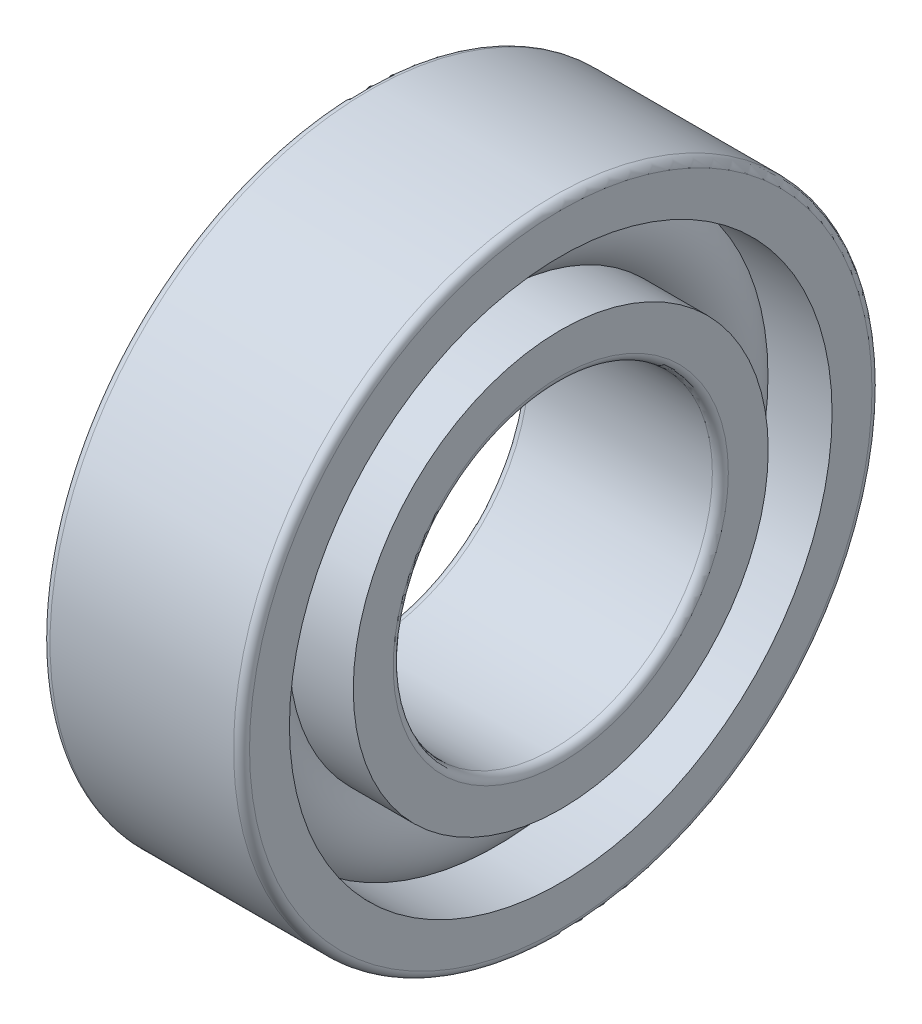
ISO-10303-21;
HEADER;
FILE_DESCRIPTION(('STEP AP214'),'2;1');
FILE_NAME('part.step','',(''),(''),'','','');
FILE_SCHEMA(('AUTOMOTIVE_DESIGN { 1 0 10303 214 1 1 1 1 }'));
ENDSEC;
DATA;
#1=APPLICATION_CONTEXT('core data for automotive mechanical design processes');
#2=APPLICATION_PROTOCOL_DEFINITION('international standard','automotive_design',2000,#1);
#3=PRODUCT_CONTEXT('',#1,'mechanical');
#4=PRODUCT('Part','Part','',(#3));
#5=PRODUCT_RELATED_PRODUCT_CATEGORY('part','',(#4));
#6=PRODUCT_DEFINITION_FORMATION('','',#4);
#7=PRODUCT_DEFINITION_CONTEXT('part definition',#1,'design');
#8=PRODUCT_DEFINITION('design','',#6,#7);
#9=PRODUCT_DEFINITION_SHAPE('','',#8);
#10=(LENGTH_UNIT() NAMED_UNIT(*) SI_UNIT(.MILLI.,.METRE.));
#11=(NAMED_UNIT(*) PLANE_ANGLE_UNIT() SI_UNIT($,.RADIAN.));
#12=(NAMED_UNIT(*) SI_UNIT($,.STERADIAN.) SOLID_ANGLE_UNIT());
#13=UNCERTAINTY_MEASURE_WITH_UNIT(LENGTH_MEASURE(1.E-05),#10,'distance_accuracy_value','');
#14=(GEOMETRIC_REPRESENTATION_CONTEXT(3) GLOBAL_UNCERTAINTY_ASSIGNED_CONTEXT((#13)) GLOBAL_UNIT_ASSIGNED_CONTEXT((#10,
#11,#12)) REPRESENTATION_CONTEXT('',''));
#15=CARTESIAN_POINT('',(0.,0.,0.));
#16=DIRECTION('',(0.,0.,1.));
#17=DIRECTION('',(1.,0.,0.));
#18=AXIS2_PLACEMENT_3D('',#15,#16,#17);
#19=CARTESIAN_POINT('',(0.,0.,0.));
#20=DIRECTION('',(-1.,0.,0.));
#21=DIRECTION('',(0.,0.,1.));
#22=AXIS2_PLACEMENT_3D('',#19,#20,#21);
#23=TOROIDAL_SURFACE('',#22,6.,1.2);
#24=CARTESIAN_POINT('',(0.894427190999912,0.,0.));
#25=DIRECTION('',(-1.,0.,0.));
#26=DIRECTION('',(0.,0.,1.));
#27=AXIS2_PLACEMENT_3D('',#24,#25,#26);
#28=CIRCLE('',#27,6.8);
#29=CARTESIAN_POINT('',(0.894427190999912,0.,6.8));
#30=VERTEX_POINT('',#29);
#31=EDGE_CURVE('E39',#30,#30,#28,.F.);
#32=ORIENTED_EDGE('',*,*,#31,.T.);
#33=EDGE_LOOP('',(#32));
#34=FACE_BOUND('',#33,.T.);
#35=CARTESIAN_POINT('',(0.894427190999914,0.,0.));
#36=DIRECTION('',(-1.,0.,0.));
#37=DIRECTION('',(0.,0.,1.));
#38=AXIS2_PLACEMENT_3D('',#35,#36,#37);
#39=CIRCLE('',#38,5.2);
#40=CARTESIAN_POINT('',(0.894427190999914,0.,5.2));
#41=VERTEX_POINT('',#40);
#42=EDGE_CURVE('E10',#41,#41,#39,.T.);
#43=ORIENTED_EDGE('',*,*,#42,.T.);
#44=EDGE_LOOP('',(#43));
#45=FACE_BOUND('',#44,.T.);
#46=ADVANCED_FACE('F35',(#34,#45),#23,.T.);
#47=CARTESIAN_POINT('',(-20.6375,0.,0.));
#48=DIRECTION('',(1.,0.,0.));
#49=DIRECTION('',(0.,0.,-1.));
#50=AXIS2_PLACEMENT_3D('',#47,#48,#49);
#51=CYLINDRICAL_SURFACE('',#50,5.2);
#52=CARTESIAN_POINT('',(2.5,0.,0.));
#53=DIRECTION('',(1.,0.,0.));
#54=DIRECTION('',(0.,0.,-1.));
#55=AXIS2_PLACEMENT_3D('',#52,#53,#54);
#56=CIRCLE('',#55,5.2);
#57=CARTESIAN_POINT('',(2.5,0.,-5.2));
#58=VERTEX_POINT('',#57);
#59=EDGE_CURVE('E48',#58,#58,#56,.T.);
#60=ORIENTED_EDGE('',*,*,#59,.F.);
#61=EDGE_LOOP('',(#60));
#62=FACE_BOUND('',#61,.T.);
#63=ORIENTED_EDGE('',*,*,#42,.F.);
#64=EDGE_LOOP('',(#63));
#65=FACE_BOUND('',#64,.T.);
#66=ADVANCED_FACE('F87',(#62,#65),#51,.T.);
#67=CARTESIAN_POINT('',(-20.6375,0.,0.));
#68=DIRECTION('',(1.,0.,0.));
#69=DIRECTION('',(0.,0.,-1.));
#70=AXIS2_PLACEMENT_3D('',#67,#68,#69);
#71=CYLINDRICAL_SURFACE('',#70,5.2);
#72=CARTESIAN_POINT('',(-2.5,0.,0.));
#73=DIRECTION('',(1.,0.,0.));
#74=DIRECTION('',(0.,0.,-1.));
#75=AXIS2_PLACEMENT_3D('',#72,#73,#74);
#76=CIRCLE('',#75,5.2);
#77=CARTESIAN_POINT('',(-2.5,0.,-5.2));
#78=VERTEX_POINT('',#77);
#79=EDGE_CURVE('E57',#78,#78,#76,.T.);
#80=ORIENTED_EDGE('',*,*,#79,.T.);
#81=EDGE_LOOP('',(#80));
#82=FACE_BOUND('',#81,.T.);
#83=CARTESIAN_POINT('',(-0.894427190999914,0.,0.));
#84=DIRECTION('',(1.,0.,0.));
#85=DIRECTION('',(0.,0.,-1.));
#86=AXIS2_PLACEMENT_3D('',#83,#84,#85);
#87=CIRCLE('',#86,5.2);
#88=CARTESIAN_POINT('',(-0.894427190999914,0.,-5.2));
#89=VERTEX_POINT('',#88);
#90=EDGE_CURVE('E43',#89,#89,#87,.T.);
#91=ORIENTED_EDGE('',*,*,#90,.F.);
#92=EDGE_LOOP('',(#91));
#93=FACE_BOUND('',#92,.T.);
#94=ADVANCED_FACE('F90',(#82,#93),#71,.T.);
#95=CARTESIAN_POINT('',(2.5,4.2,0.));
#96=DIRECTION('',(1.,0.,0.));
#97=DIRECTION('',(0.,0.,-1.));
#98=AXIS2_PLACEMENT_3D('',#95,#96,#97);
#99=PLANE('',#98);
#100=ORIENTED_EDGE('',*,*,#59,.T.);
#101=EDGE_LOOP('',(#100));
#102=FACE_BOUND('',#101,.T.);
#103=CARTESIAN_POINT('',(2.5,0.,0.));
#104=DIRECTION('',(1.,0.,0.));
#105=DIRECTION('',(0.,0.,-1.));
#106=AXIS2_PLACEMENT_3D('',#103,#104,#105);
#107=CIRCLE('',#106,4.2);
#108=CARTESIAN_POINT('',(2.5,0.,-4.2));
#109=VERTEX_POINT('',#108);
#110=EDGE_CURVE('E79',#109,#109,#107,.T.);
#111=ORIENTED_EDGE('',*,*,#110,.F.);
#112=EDGE_LOOP('',(#111));
#113=FACE_BOUND('',#112,.T.);
#114=ADVANCED_FACE('F84',(#102,#113),#99,.T.);
#115=CARTESIAN_POINT('',(2.3,0.,0.));
#116=DIRECTION('',(1.,0.,0.));
#117=DIRECTION('',(0.,0.,-1.));
#118=AXIS2_PLACEMENT_3D('',#115,#116,#117);
#119=TOROIDAL_SURFACE('',#118,4.2,0.2);
#120=ORIENTED_EDGE('',*,*,#110,.T.);
#121=EDGE_LOOP('',(#120));
#122=FACE_BOUND('',#121,.T.);
#123=CARTESIAN_POINT('',(2.3,0.,0.));
#124=DIRECTION('',(1.,0.,0.));
#125=DIRECTION('',(0.,0.,-1.));
#126=AXIS2_PLACEMENT_3D('',#123,#124,#125);
#127=CIRCLE('',#126,4.);
#128=CARTESIAN_POINT('',(2.3,0.,-4.));
#129=VERTEX_POINT('',#128);
#130=EDGE_CURVE('E76',#129,#129,#127,.T.);
#131=ORIENTED_EDGE('',*,*,#130,.F.);
#132=EDGE_LOOP('',(#131));
#133=FACE_BOUND('',#132,.T.);
#134=ADVANCED_FACE('F101',(#122,#133),#119,.T.);
#135=CARTESIAN_POINT('',(-20.6375,0.,0.));
#136=DIRECTION('',(1.,0.,0.));
#137=DIRECTION('',(0.,0.,-1.));
#138=AXIS2_PLACEMENT_3D('',#135,#136,#137);
#139=CYLINDRICAL_SURFACE('',#138,4.);
#140=ORIENTED_EDGE('',*,*,#130,.T.);
#141=EDGE_LOOP('',(#140));
#142=FACE_BOUND('',#141,.T.);
#143=CARTESIAN_POINT('',(-2.3,0.,0.));
#144=DIRECTION('',(1.,0.,0.));
#145=DIRECTION('',(0.,0.,-1.));
#146=AXIS2_PLACEMENT_3D('',#143,#144,#145);
#147=CIRCLE('',#146,4.);
#148=CARTESIAN_POINT('',(-2.3,0.,-4.));
#149=VERTEX_POINT('',#148);
#150=EDGE_CURVE('E73',#149,#149,#147,.T.);
#151=ORIENTED_EDGE('',*,*,#150,.F.);
#152=EDGE_LOOP('',(#151));
#153=FACE_BOUND('',#152,.T.);
#154=ADVANCED_FACE('F104',(#142,#153),#139,.F.);
#155=CARTESIAN_POINT('',(-2.3,0.,0.));
#156=DIRECTION('',(1.,0.,0.));
#157=DIRECTION('',(0.,0.,-1.));
#158=AXIS2_PLACEMENT_3D('',#155,#156,#157);
#159=TOROIDAL_SURFACE('',#158,4.2,0.2);
#160=ORIENTED_EDGE('',*,*,#150,.T.);
#161=EDGE_LOOP('',(#160));
#162=FACE_BOUND('',#161,.T.);
#163=CARTESIAN_POINT('',(-2.5,0.,0.));
#164=DIRECTION('',(1.,0.,0.));
#165=DIRECTION('',(0.,0.,-1.));
#166=AXIS2_PLACEMENT_3D('',#163,#164,#165);
#167=CIRCLE('',#166,4.2);
#168=CARTESIAN_POINT('',(-2.5,0.,-4.2));
#169=VERTEX_POINT('',#168);
#170=EDGE_CURVE('E70',#169,#169,#167,.T.);
#171=ORIENTED_EDGE('',*,*,#170,.F.);
#172=EDGE_LOOP('',(#171));
#173=FACE_BOUND('',#172,.T.);
#174=ADVANCED_FACE('F108',(#162,#173),#159,.T.);
#175=CARTESIAN_POINT('',(-2.5,5.2,0.));
#176=DIRECTION('',(-1.,0.,0.));
#177=DIRECTION('',(0.,0.,1.));
#178=AXIS2_PLACEMENT_3D('',#175,#176,#177);
#179=PLANE('',#178);
#180=ORIENTED_EDGE('',*,*,#170,.T.);
#181=EDGE_LOOP('',(#180));
#182=FACE_BOUND('',#181,.T.);
#183=ORIENTED_EDGE('',*,*,#79,.F.);
#184=EDGE_LOOP('',(#183));
#185=FACE_BOUND('',#184,.T.);
#186=ADVANCED_FACE('F112',(#182,#185),#179,.T.);
#187=CARTESIAN_POINT('',(-0.894427190999912,0.,0.));
#188=DIRECTION('',(1.,0.,0.));
#189=DIRECTION('',(0.,0.,-1.));
#190=AXIS2_PLACEMENT_3D('',#187,#188,#189);
#191=CIRCLE('',#190,6.8);
#192=CARTESIAN_POINT('',(-0.894427190999912,0.,-6.8));
#193=VERTEX_POINT('',#192);
#194=EDGE_CURVE('E51',#193,#193,#191,.F.);
#195=ORIENTED_EDGE('',*,*,#194,.T.);
#196=EDGE_LOOP('',(#195));
#197=FACE_BOUND('',#196,.T.);
#198=ORIENTED_EDGE('',*,*,#90,.T.);
#199=EDGE_LOOP('',(#198));
#200=FACE_BOUND('',#199,.T.);
#201=ADVANCED_FACE('F37',(#197,#200),#23,.T.);
#202=CARTESIAN_POINT('',(-20.6375,0.,0.));
#203=DIRECTION('',(1.,0.,0.));
#204=DIRECTION('',(0.,0.,-1.));
#205=AXIS2_PLACEMENT_3D('',#202,#203,#204);
#206=CYLINDRICAL_SURFACE('',#205,6.8);
#207=CARTESIAN_POINT('',(2.5,0.,0.));
#208=DIRECTION('',(1.,0.,0.));
#209=DIRECTION('',(0.,0.,-1.));
#210=AXIS2_PLACEMENT_3D('',#207,#208,#209);
#211=CIRCLE('',#210,6.8);
#212=CARTESIAN_POINT('',(2.5,0.,-6.8));
#213=VERTEX_POINT('',#212);
#214=EDGE_CURVE('E53',#213,#213,#211,.T.);
#215=ORIENTED_EDGE('',*,*,#214,.T.);
#216=EDGE_LOOP('',(#215));
#217=FACE_BOUND('',#216,.T.);
#218=ORIENTED_EDGE('',*,*,#31,.F.);
#219=EDGE_LOOP('',(#218));
#220=FACE_BOUND('',#219,.T.);
#221=ADVANCED_FACE('F117',(#217,#220),#206,.F.);
#222=CARTESIAN_POINT('',(-20.6375,0.,0.));
#223=DIRECTION('',(1.,0.,0.));
#224=DIRECTION('',(0.,0.,-1.));
#225=AXIS2_PLACEMENT_3D('',#222,#223,#224);
#226=CYLINDRICAL_SURFACE('',#225,6.8);
#227=CARTESIAN_POINT('',(-2.5,0.,0.));
#228=DIRECTION('',(1.,0.,0.));
#229=DIRECTION('',(0.,0.,-1.));
#230=AXIS2_PLACEMENT_3D('',#227,#228,#229);
#231=CIRCLE('',#230,6.8);
#232=CARTESIAN_POINT('',(-2.5,0.,-6.8));
#233=VERTEX_POINT('',#232);
#234=EDGE_CURVE('E148',#233,#233,#231,.T.);
#235=ORIENTED_EDGE('',*,*,#234,.F.);
#236=EDGE_LOOP('',(#235));
#237=FACE_BOUND('',#236,.T.);
#238=ORIENTED_EDGE('',*,*,#194,.F.);
#239=EDGE_LOOP('',(#238));
#240=FACE_BOUND('',#239,.T.);
#241=ADVANCED_FACE('F120',(#237,#240),#226,.F.);
#242=CARTESIAN_POINT('',(2.5,7.80000000000001,0.));
#243=DIRECTION('',(1.,0.,0.));
#244=DIRECTION('',(0.,0.,-1.));
#245=AXIS2_PLACEMENT_3D('',#242,#243,#244);
#246=PLANE('',#245);
#247=CARTESIAN_POINT('',(2.5,0.,0.));
#248=DIRECTION('',(1.,0.,0.));
#249=DIRECTION('',(0.,0.,-1.));
#250=AXIS2_PLACEMENT_3D('',#247,#248,#249);
#251=CIRCLE('',#250,7.80000000000001);
#252=CARTESIAN_POINT('',(2.5,0.,-7.80000000000001));
#253=VERTEX_POINT('',#252);
#254=EDGE_CURVE('E59',#253,#253,#251,.T.);
#255=ORIENTED_EDGE('',*,*,#254,.T.);
#256=EDGE_LOOP('',(#255));
#257=FACE_BOUND('',#256,.T.);
#258=ORIENTED_EDGE('',*,*,#214,.F.);
#259=EDGE_LOOP('',(#258));
#260=FACE_BOUND('',#259,.T.);
#261=ADVANCED_FACE('F121',(#257,#260),#246,.T.);
#262=CARTESIAN_POINT('',(2.3,0.,0.));
#263=DIRECTION('',(1.,0.,0.));
#264=DIRECTION('',(0.,0.,-1.));
#265=AXIS2_PLACEMENT_3D('',#262,#263,#264);
#266=TOROIDAL_SURFACE('',#265,7.80000000000001,0.200000000000001);
#267=CARTESIAN_POINT('',(2.3,0.,0.));
#268=DIRECTION('',(1.,0.,0.));
#269=DIRECTION('',(0.,0.,-1.));
#270=AXIS2_PLACEMENT_3D('',#267,#268,#269);
#271=CIRCLE('',#270,8.00000000000001);
#272=CARTESIAN_POINT('',(2.3,0.,-8.00000000000001));
#273=VERTEX_POINT('',#272);
#274=EDGE_CURVE('E64',#273,#273,#271,.T.);
#275=ORIENTED_EDGE('',*,*,#274,.T.);
#276=EDGE_LOOP('',(#275));
#277=FACE_BOUND('',#276,.T.);
#278=ORIENTED_EDGE('',*,*,#254,.F.);
#279=EDGE_LOOP('',(#278));
#280=FACE_BOUND('',#279,.T.);
#281=ADVANCED_FACE('F124',(#277,#280),#266,.T.);
#282=CARTESIAN_POINT('',(-20.6375,0.,0.));
#283=DIRECTION('',(1.,0.,0.));
#284=DIRECTION('',(0.,0.,-1.));
#285=AXIS2_PLACEMENT_3D('',#282,#283,#284);
#286=CYLINDRICAL_SURFACE('',#285,8.00000000000001);
#287=CARTESIAN_POINT('',(-2.3,0.,0.));
#288=DIRECTION('',(1.,0.,0.));
#289=DIRECTION('',(0.,0.,-1.));
#290=AXIS2_PLACEMENT_3D('',#287,#288,#289);
#291=CIRCLE('',#290,8.00000000000001);
#292=CARTESIAN_POINT('',(-2.3,0.,-8.00000000000001));
#293=VERTEX_POINT('',#292);
#294=EDGE_CURVE('E152',#293,#293,#291,.T.);
#295=ORIENTED_EDGE('',*,*,#294,.T.);
#296=EDGE_LOOP('',(#295));
#297=FACE_BOUND('',#296,.T.);
#298=ORIENTED_EDGE('',*,*,#274,.F.);
#299=EDGE_LOOP('',(#298));
#300=FACE_BOUND('',#299,.T.);
#301=ADVANCED_FACE('F128',(#297,#300),#286,.T.);
#302=CARTESIAN_POINT('',(-2.3,0.,0.));
#303=DIRECTION('',(1.,0.,0.));
#304=DIRECTION('',(0.,0.,-1.));
#305=AXIS2_PLACEMENT_3D('',#302,#303,#304);
#306=TOROIDAL_SURFACE('',#305,7.80000000000001,0.200000000000001);
#307=CARTESIAN_POINT('',(-2.5,0.,0.));
#308=DIRECTION('',(1.,0.,0.));
#309=DIRECTION('',(0.,0.,-1.));
#310=AXIS2_PLACEMENT_3D('',#307,#308,#309);
#311=CIRCLE('',#310,7.80000000000001);
#312=CARTESIAN_POINT('',(-2.5,0.,-7.80000000000001));
#313=VERTEX_POINT('',#312);
#314=EDGE_CURVE('E149',#313,#313,#311,.T.);
#315=ORIENTED_EDGE('',*,*,#314,.T.);
#316=EDGE_LOOP('',(#315));
#317=FACE_BOUND('',#316,.T.);
#318=ORIENTED_EDGE('',*,*,#294,.F.);
#319=EDGE_LOOP('',(#318));
#320=FACE_BOUND('',#319,.T.);
#321=ADVANCED_FACE('F132',(#317,#320),#306,.T.);
#322=CARTESIAN_POINT('',(-2.5,6.8,0.));
#323=DIRECTION('',(-1.,0.,0.));
#324=DIRECTION('',(0.,0.,1.));
#325=AXIS2_PLACEMENT_3D('',#322,#323,#324);
#326=PLANE('',#325);
#327=ORIENTED_EDGE('',*,*,#234,.T.);
#328=EDGE_LOOP('',(#327));
#329=FACE_BOUND('',#328,.T.);
#330=ORIENTED_EDGE('',*,*,#314,.F.);
#331=EDGE_LOOP('',(#330));
#332=FACE_BOUND('',#331,.T.);
#333=ADVANCED_FACE('F136',(#329,#332),#326,.T.);
#334=CLOSED_SHELL('',(#46,#66,#94,#114,#134,#154,#174,#186,#201,#221,#241,#261,#281,#301,#321,#333));
#335=MANIFOLD_SOLID_BREP('B2',#334);
#336=ADVANCED_BREP_SHAPE_REPRESENTATION('',(#18,#335),#14);
#337=SHAPE_DEFINITION_REPRESENTATION(#9,#336);
ENDSEC;
END-ISO-10303-21;
